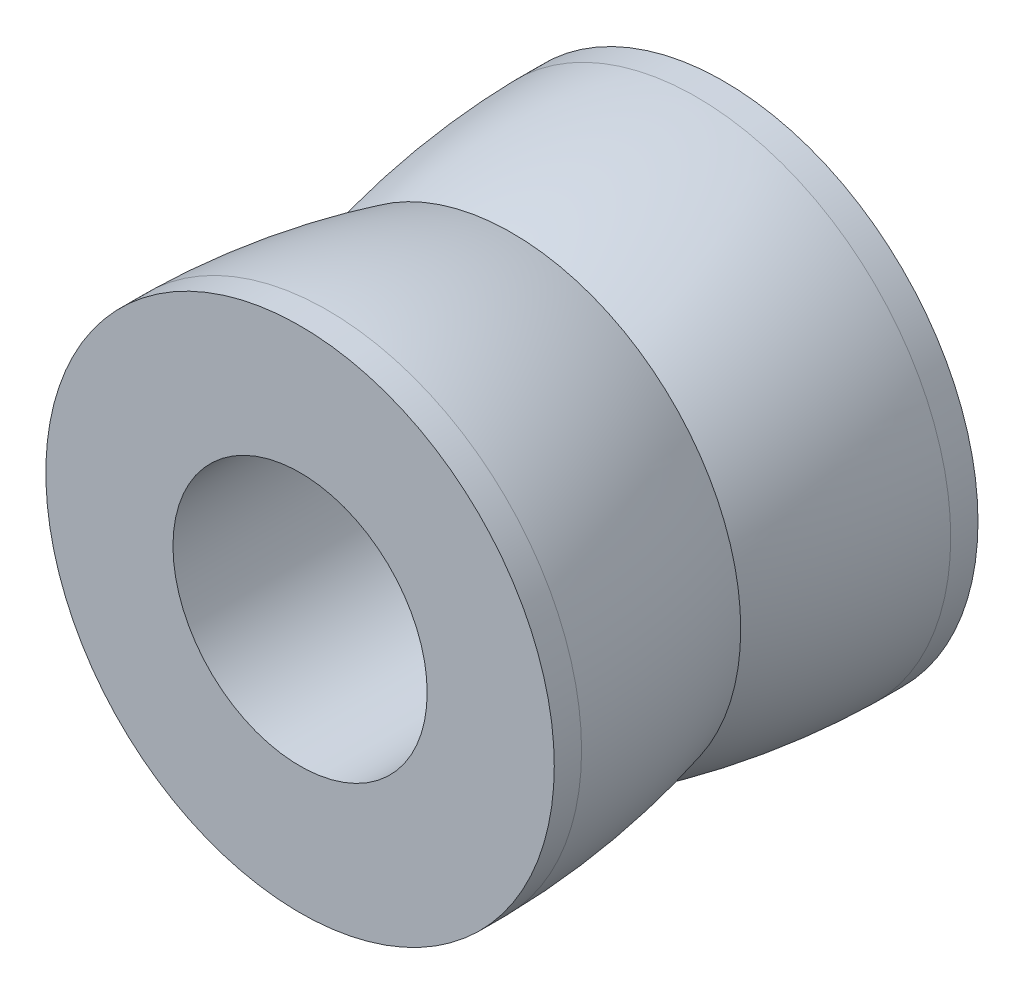
ISO-10303-21;
HEADER;
FILE_DESCRIPTION(('STEP AP214'),'2;1');
FILE_NAME('part.step','',(''),(''),'','','');
FILE_SCHEMA(('AUTOMOTIVE_DESIGN { 1 0 10303 214 1 1 1 1 }'));
ENDSEC;
DATA;
#1=APPLICATION_CONTEXT('core data for automotive mechanical design processes');
#2=APPLICATION_PROTOCOL_DEFINITION('international standard','automotive_design',2000,#1);
#3=PRODUCT_CONTEXT('',#1,'mechanical');
#4=PRODUCT('Part','Part','',(#3));
#5=PRODUCT_RELATED_PRODUCT_CATEGORY('part','',(#4));
#6=PRODUCT_DEFINITION_FORMATION('','',#4);
#7=PRODUCT_DEFINITION_CONTEXT('part definition',#1,'design');
#8=PRODUCT_DEFINITION('design','',#6,#7);
#9=PRODUCT_DEFINITION_SHAPE('','',#8);
#10=(LENGTH_UNIT() NAMED_UNIT(*) SI_UNIT(.MILLI.,.METRE.));
#11=(NAMED_UNIT(*) PLANE_ANGLE_UNIT() SI_UNIT($,.RADIAN.));
#12=(NAMED_UNIT(*) SI_UNIT($,.STERADIAN.) SOLID_ANGLE_UNIT());
#13=UNCERTAINTY_MEASURE_WITH_UNIT(LENGTH_MEASURE(1.E-05),#10,'distance_accuracy_value','');
#14=(GEOMETRIC_REPRESENTATION_CONTEXT(3) GLOBAL_UNCERTAINTY_ASSIGNED_CONTEXT((#13)) GLOBAL_UNIT_ASSIGNED_CONTEXT((#10,
#11,#12)) REPRESENTATION_CONTEXT('',''));
#15=CARTESIAN_POINT('',(0.,0.,0.));
#16=DIRECTION('',(0.,0.,1.));
#17=DIRECTION('',(1.,0.,0.));
#18=AXIS2_PLACEMENT_3D('',#15,#16,#17);
#19=CARTESIAN_POINT('',(0.,0.,10.));
#20=DIRECTION('',(0.,0.,-1.));
#21=DIRECTION('',(-1.,0.,0.));
#22=AXIS2_PLACEMENT_3D('',#19,#20,#21);
#23=CYLINDRICAL_SURFACE('',#22,6.);
#24=CARTESIAN_POINT('',(0.,0.,10.));
#25=DIRECTION('',(0.,0.,1.));
#26=DIRECTION('',(1.,0.,0.));
#27=AXIS2_PLACEMENT_3D('',#24,#25,#26);
#28=CIRCLE('',#27,6.);
#29=CARTESIAN_POINT('',(6.,0.,10.));
#30=VERTEX_POINT('',#29);
#31=EDGE_CURVE('E10',#30,#30,#28,.T.);
#32=ORIENTED_EDGE('',*,*,#31,.F.);
#33=EDGE_LOOP('',(#32));
#34=FACE_BOUND('',#33,.T.);
#35=CARTESIAN_POINT('',(0.,0.,9.35599584814689));
#36=DIRECTION('',(0.,0.,1.));
#37=DIRECTION('',(1.,0.,0.));
#38=AXIS2_PLACEMENT_3D('',#35,#36,#37);
#39=CIRCLE('',#38,6.);
#40=CARTESIAN_POINT('',(6.,0.,9.35599584814689));
#41=VERTEX_POINT('',#40);
#42=EDGE_CURVE('E63',#41,#41,#39,.T.);
#43=ORIENTED_EDGE('',*,*,#42,.T.);
#44=EDGE_LOOP('',(#43));
#45=FACE_BOUND('',#44,.T.);
#46=ADVANCED_FACE('F37',(#34,#45),#23,.T.);
#47=CARTESIAN_POINT('',(0.,0.,10.));
#48=DIRECTION('',(0.,0.,1.));
#49=DIRECTION('',(1.,0.,0.));
#50=AXIS2_PLACEMENT_3D('',#47,#48,#49);
#51=PLANE('',#50);
#52=ORIENTED_EDGE('',*,*,#31,.T.);
#53=EDGE_LOOP('',(#52));
#54=FACE_BOUND('',#53,.T.);
#55=CARTESIAN_POINT('',(0.,0.,10.));
#56=DIRECTION('',(0.,0.,1.));
#57=DIRECTION('',(1.,0.,0.));
#58=AXIS2_PLACEMENT_3D('',#55,#56,#57);
#59=CIRCLE('',#58,3.);
#60=CARTESIAN_POINT('',(3.,0.,10.));
#61=VERTEX_POINT('',#60);
#62=EDGE_CURVE('E50',#61,#61,#59,.T.);
#63=ORIENTED_EDGE('',*,*,#62,.F.);
#64=EDGE_LOOP('',(#63));
#65=FACE_BOUND('',#64,.T.);
#66=ADVANCED_FACE('F89',(#54,#65),#51,.T.);
#67=CARTESIAN_POINT('',(0.,0.,0.));
#68=DIRECTION('',(0.,0.,1.));
#69=DIRECTION('',(1.,0.,0.));
#70=AXIS2_PLACEMENT_3D('',#67,#68,#69);
#71=PLANE('',#70);
#72=CARTESIAN_POINT('',(0.,0.,0.));
#73=DIRECTION('',(0.,0.,1.));
#74=DIRECTION('',(1.,0.,0.));
#75=AXIS2_PLACEMENT_3D('',#72,#73,#74);
#76=CIRCLE('',#75,6.);
#77=CARTESIAN_POINT('',(6.,0.,0.));
#78=VERTEX_POINT('',#77);
#79=EDGE_CURVE('E41',#78,#78,#76,.T.);
#80=ORIENTED_EDGE('',*,*,#79,.F.);
#81=EDGE_LOOP('',(#80));
#82=FACE_BOUND('',#81,.T.);
#83=CARTESIAN_POINT('',(0.,0.,0.));
#84=DIRECTION('',(0.,0.,1.));
#85=DIRECTION('',(1.,0.,0.));
#86=AXIS2_PLACEMENT_3D('',#83,#84,#85);
#87=CIRCLE('',#86,3.);
#88=CARTESIAN_POINT('',(3.,0.,0.));
#89=VERTEX_POINT('',#88);
#90=EDGE_CURVE('E52',#89,#89,#87,.T.);
#91=ORIENTED_EDGE('',*,*,#90,.T.);
#92=EDGE_LOOP('',(#91));
#93=FACE_BOUND('',#92,.T.);
#94=ADVANCED_FACE('F84',(#82,#93),#71,.F.);
#95=CARTESIAN_POINT('',(0.,0.,0.644004151853112));
#96=DIRECTION('',(0.,0.,1.));
#97=DIRECTION('',(1.,0.,0.));
#98=AXIS2_PLACEMENT_3D('',#95,#96,#97);
#99=CIRCLE('',#98,6.);
#100=CARTESIAN_POINT('',(6.,0.,0.644004151853112));
#101=VERTEX_POINT('',#100);
#102=EDGE_CURVE('E56',#101,#101,#99,.T.);
#103=ORIENTED_EDGE('',*,*,#102,.F.);
#104=EDGE_LOOP('',(#103));
#105=FACE_BOUND('',#104,.T.);
#106=ORIENTED_EDGE('',*,*,#79,.T.);
#107=EDGE_LOOP('',(#106));
#108=FACE_BOUND('',#107,.T.);
#109=ADVANCED_FACE('F39',(#105,#108),#23,.T.);
#110=CARTESIAN_POINT('',(0.,0.,10.));
#111=DIRECTION('',(0.,0.,-1.));
#112=DIRECTION('',(-1.,0.,0.));
#113=AXIS2_PLACEMENT_3D('',#110,#111,#112);
#114=CYLINDRICAL_SURFACE('',#113,3.);
#115=ORIENTED_EDGE('',*,*,#62,.T.);
#116=EDGE_LOOP('',(#115));
#117=FACE_BOUND('',#116,.T.);
#118=ORIENTED_EDGE('',*,*,#90,.F.);
#119=EDGE_LOOP('',(#118));
#120=FACE_BOUND('',#119,.T.);
#121=ADVANCED_FACE('F78',(#117,#120),#114,.F.);
#122=CARTESIAN_POINT('',(0.,0.,0.322002075926583));
#123=DIRECTION('',(0.,0.,1.));
#124=DIRECTION('',(1.,0.,0.));
#125=AXIS2_PLACEMENT_3D('',#122,#123,#124);
#126=DEGENERATE_TOROIDAL_SURFACE('',#125,12.4499827006119,18.4527923900362,.F.);
#127=CARTESIAN_POINT('',(0.,0.,5.00000000000001));
#128=DIRECTION('',(0.,0.,1.));
#129=DIRECTION('',(1.,0.,0.));
#130=AXIS2_PLACEMENT_3D('',#127,#128,#129);
#131=CIRCLE('',#130,5.4);
#132=CARTESIAN_POINT('',(5.4,0.,5.00000000000001));
#133=VERTEX_POINT('',#132);
#134=EDGE_CURVE('E67',#133,#133,#131,.T.);
#135=ORIENTED_EDGE('',*,*,#134,.F.);
#136=EDGE_LOOP('',(#135));
#137=FACE_BOUND('',#136,.T.);
#138=ORIENTED_EDGE('',*,*,#102,.T.);
#139=EDGE_LOOP('',(#138));
#140=FACE_BOUND('',#139,.T.);
#141=ADVANCED_FACE('F75',(#137,#140),#126,.F.);
#142=CARTESIAN_POINT('',(0.,0.,9.67799792407342));
#143=DIRECTION('',(0.,0.,1.));
#144=DIRECTION('',(1.,0.,0.));
#145=AXIS2_PLACEMENT_3D('',#142,#143,#144);
#146=DEGENERATE_TOROIDAL_SURFACE('',#145,12.4499827006119,18.4527923900362,.F.);
#147=ORIENTED_EDGE('',*,*,#134,.T.);
#148=EDGE_LOOP('',(#147));
#149=FACE_BOUND('',#148,.T.);
#150=ORIENTED_EDGE('',*,*,#42,.F.);
#151=EDGE_LOOP('',(#150));
#152=FACE_BOUND('',#151,.T.);
#153=ADVANCED_FACE('F72',(#149,#152),#146,.F.);
#154=CLOSED_SHELL('',(#46,#66,#94,#109,#121,#141,#153));
#155=MANIFOLD_SOLID_BREP('B2',#154);
#156=ADVANCED_BREP_SHAPE_REPRESENTATION('',(#18,#155),#14);
#157=SHAPE_DEFINITION_REPRESENTATION(#9,#156);
ENDSEC;
END-ISO-10303-21;
